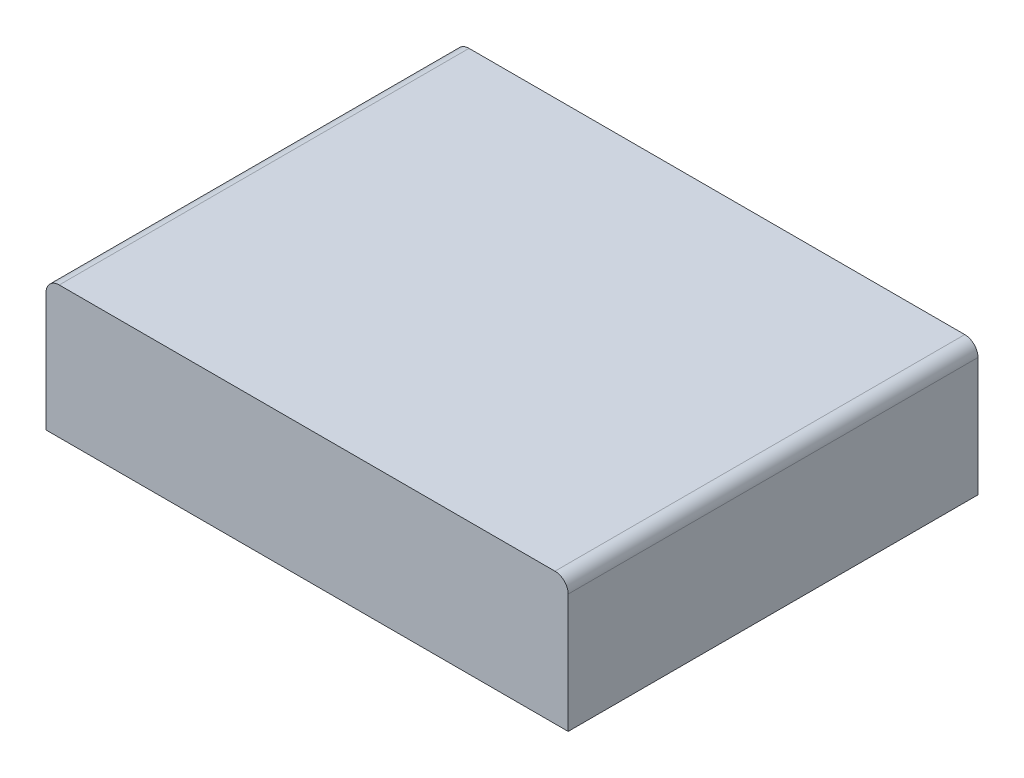
ISO-10303-21;
HEADER;
FILE_DESCRIPTION(('STEP AP214'),'2;1');
FILE_NAME('part.step','',(''),(''),'','','');
FILE_SCHEMA(('AUTOMOTIVE_DESIGN { 1 0 10303 214 1 1 1 1 }'));
ENDSEC;
DATA;
#1=APPLICATION_CONTEXT('core data for automotive mechanical design processes');
#2=APPLICATION_PROTOCOL_DEFINITION('international standard','automotive_design',2000,#1);
#3=PRODUCT_CONTEXT('',#1,'mechanical');
#4=PRODUCT('Part','Part','',(#3));
#5=PRODUCT_RELATED_PRODUCT_CATEGORY('part','',(#4));
#6=PRODUCT_DEFINITION_FORMATION('','',#4);
#7=PRODUCT_DEFINITION_CONTEXT('part definition',#1,'design');
#8=PRODUCT_DEFINITION('design','',#6,#7);
#9=PRODUCT_DEFINITION_SHAPE('','',#8);
#10=(LENGTH_UNIT() NAMED_UNIT(*) SI_UNIT(.MILLI.,.METRE.));
#11=(NAMED_UNIT(*) PLANE_ANGLE_UNIT() SI_UNIT($,.RADIAN.));
#12=(NAMED_UNIT(*) SI_UNIT($,.STERADIAN.) SOLID_ANGLE_UNIT());
#13=UNCERTAINTY_MEASURE_WITH_UNIT(LENGTH_MEASURE(1.E-05),#10,'distance_accuracy_value','');
#14=(GEOMETRIC_REPRESENTATION_CONTEXT(3) GLOBAL_UNCERTAINTY_ASSIGNED_CONTEXT((#13)) GLOBAL_UNIT_ASSIGNED_CONTEXT((#10,
#11,#12)) REPRESENTATION_CONTEXT('',''));
#15=CARTESIAN_POINT('',(0.,0.,0.));
#16=DIRECTION('',(0.,0.,1.));
#17=DIRECTION('',(1.,0.,0.));
#18=AXIS2_PLACEMENT_3D('',#15,#16,#17);
#19=CARTESIAN_POINT('',(-0.348761325789842,39.1976983767566,241.578801425629));
#20=DIRECTION('',(0.,0.,1.));
#21=DIRECTION('',(1.,0.,0.));
#22=AXIS2_PLACEMENT_3D('',#19,#20,#21);
#23=CYLINDRICAL_SURFACE('',#22,0.0508);
#24=CARTESIAN_POINT('',(-0.348761325789842,39.1976983767566,240.791401425628));
#25=DIRECTION('',(0.,0.,1.));
#26=DIRECTION('',(1.,0.,0.));
#27=AXIS2_PLACEMENT_3D('',#24,#25,#26);
#28=CIRCLE('',#27,0.0508);
#29=CARTESIAN_POINT('',(-0.348761325789842,39.2484983767566,240.791401425628));
#30=VERTEX_POINT('',#29);
#31=CARTESIAN_POINT('',(-0.399561325789846,39.1976983767566,240.791401425628));
#32=VERTEX_POINT('',#31);
#33=EDGE_CURVE('E126',#30,#32,#28,.T.);
#34=ORIENTED_EDGE('',*,*,#33,.T.);
#35=DIRECTION('',(0.,0.,-1.));
#36=VECTOR('',#35,1.);
#37=CARTESIAN_POINT('',(-0.399561325789846,39.1976983767566,242.366201425629));
#38=LINE('',#37,#36);
#39=CARTESIAN_POINT('',(-0.399561325789846,39.1976983767566,242.366201425629));
#40=VERTEX_POINT('',#39);
#41=EDGE_CURVE('E108',#32,#40,#38,.F.);
#42=ORIENTED_EDGE('',*,*,#41,.T.);
#43=CARTESIAN_POINT('',(-0.348761325789842,39.1976983767566,242.366201425629));
#44=DIRECTION('',(0.,0.,1.));
#45=DIRECTION('',(1.,0.,0.));
#46=AXIS2_PLACEMENT_3D('',#43,#44,#45);
#47=CIRCLE('',#46,0.0508);
#48=CARTESIAN_POINT('',(-0.348761325789842,39.2484983767566,242.366201425629));
#49=VERTEX_POINT('',#48);
#50=EDGE_CURVE('E20',#40,#49,#47,.F.);
#51=ORIENTED_EDGE('',*,*,#50,.T.);
#52=DIRECTION('',(0.,0.,-1.));
#53=VECTOR('',#52,1.);
#54=CARTESIAN_POINT('',(-0.348761325789842,39.2484983767566,241.578801425629));
#55=LINE('',#54,#53);
#56=EDGE_CURVE('E104',#49,#30,#55,.T.);
#57=ORIENTED_EDGE('',*,*,#56,.T.);
#58=EDGE_LOOP('',(#34,#42,#51,#57));
#59=FACE_BOUND('',#58,.T.);
#60=ADVANCED_FACE('F17',(#59),#23,.T.);
#61=CARTESIAN_POINT('',(1.55623867421015,39.1976983767566,241.578801425629));
#62=DIRECTION('',(0.,0.,-1.));
#63=DIRECTION('',(-1.,0.,0.));
#64=AXIS2_PLACEMENT_3D('',#61,#62,#63);
#65=CYLINDRICAL_SURFACE('',#64,0.0508);
#66=CARTESIAN_POINT('',(1.55623867421015,39.1976983767566,242.366201425629));
#67=DIRECTION('',(0.,0.,-1.));
#68=DIRECTION('',(-1.,0.,0.));
#69=AXIS2_PLACEMENT_3D('',#66,#67,#68);
#70=CIRCLE('',#69,0.0508);
#71=CARTESIAN_POINT('',(1.55623867421015,39.2484983767566,242.366201425629));
#72=VERTEX_POINT('',#71);
#73=CARTESIAN_POINT('',(1.60703867421016,39.1976983767566,242.366201425629));
#74=VERTEX_POINT('',#73);
#75=EDGE_CURVE('E113',#72,#74,#70,.T.);
#76=ORIENTED_EDGE('',*,*,#75,.T.);
#77=DIRECTION('',(0.,0.,1.));
#78=VECTOR('',#77,1.);
#79=CARTESIAN_POINT('',(1.60703867421016,39.1976983767566,242.366201425629));
#80=LINE('',#79,#78);
#81=CARTESIAN_POINT('',(1.60703867421016,39.1976983767566,240.791401425628));
#82=VERTEX_POINT('',#81);
#83=EDGE_CURVE('E100',#74,#82,#80,.F.);
#84=ORIENTED_EDGE('',*,*,#83,.T.);
#85=CARTESIAN_POINT('',(1.55623867421015,39.1976983767566,240.791401425628));
#86=DIRECTION('',(0.,0.,-1.));
#87=DIRECTION('',(-1.,0.,0.));
#88=AXIS2_PLACEMENT_3D('',#85,#86,#87);
#89=CIRCLE('',#88,0.0508);
#90=CARTESIAN_POINT('',(1.55623867421015,39.2484983767566,240.791401425628));
#91=VERTEX_POINT('',#90);
#92=EDGE_CURVE('E122',#82,#91,#89,.F.);
#93=ORIENTED_EDGE('',*,*,#92,.T.);
#94=DIRECTION('',(0.,0.,-1.));
#95=VECTOR('',#94,1.);
#96=CARTESIAN_POINT('',(1.55623867421015,39.2484983767566,241.578801425629));
#97=LINE('',#96,#95);
#98=EDGE_CURVE('E109',#91,#72,#97,.F.);
#99=ORIENTED_EDGE('',*,*,#98,.T.);
#100=EDGE_LOOP('',(#76,#84,#93,#99));
#101=FACE_BOUND('',#100,.T.);
#102=ADVANCED_FACE('F161',(#101),#65,.T.);
#103=CARTESIAN_POINT('',(0.603738674210153,39.2484983767566,241.578801425629));
#104=DIRECTION('',(0.,-1.,0.));
#105=DIRECTION('',(0.,0.,-1.));
#106=AXIS2_PLACEMENT_3D('',#103,#104,#105);
#107=PLANE('',#106);
#108=DIRECTION('',(-1.,0.,0.));
#109=VECTOR('',#108,1.);
#110=CARTESIAN_POINT('',(-0.399561325789846,39.2484983767566,242.366201425629));
#111=LINE('',#110,#109);
#112=EDGE_CURVE('E137',#49,#72,#111,.F.);
#113=ORIENTED_EDGE('',*,*,#112,.T.);
#114=ORIENTED_EDGE('',*,*,#98,.F.);
#115=DIRECTION('',(1.,0.,0.));
#116=VECTOR('',#115,1.);
#117=CARTESIAN_POINT('',(-0.399561325789846,39.2484983767566,240.791401425628));
#118=LINE('',#117,#116);
#119=EDGE_CURVE('E117',#91,#30,#118,.F.);
#120=ORIENTED_EDGE('',*,*,#119,.T.);
#121=ORIENTED_EDGE('',*,*,#56,.F.);
#122=EDGE_LOOP('',(#113,#114,#120,#121));
#123=FACE_BOUND('',#122,.T.);
#124=ADVANCED_FACE('F135',(#123),#107,.F.);
#125=CARTESIAN_POINT('',(-0.399561325789846,39.2484983767566,242.366201425629));
#126=DIRECTION('',(1.,0.,0.));
#127=DIRECTION('',(0.,0.,-1.));
#128=AXIS2_PLACEMENT_3D('',#125,#126,#127);
#129=PLANE('',#128);
#130=DIRECTION('',(0.,1.,0.));
#131=VECTOR('',#130,1.);
#132=CARTESIAN_POINT('',(-0.399561325789846,39.2484983767566,240.791401425628));
#133=LINE('',#132,#131);
#134=CARTESIAN_POINT('',(-0.399561325789846,38.7404983767566,240.791401425628));
#135=VERTEX_POINT('',#134);
#136=EDGE_CURVE('E79',#32,#135,#133,.F.);
#137=ORIENTED_EDGE('',*,*,#136,.T.);
#138=DIRECTION('',(0.,0.,-1.));
#139=VECTOR('',#138,1.);
#140=CARTESIAN_POINT('',(-0.399561325789846,38.7404983767566,241.578801425629));
#141=LINE('',#140,#139);
#142=CARTESIAN_POINT('',(-0.399561325789846,38.7404983767566,242.366201425629));
#143=VERTEX_POINT('',#142);
#144=EDGE_CURVE('E74',#143,#135,#141,.T.);
#145=ORIENTED_EDGE('',*,*,#144,.F.);
#146=DIRECTION('',(0.,1.,0.));
#147=VECTOR('',#146,1.);
#148=CARTESIAN_POINT('',(-0.399561325789846,39.2484983767566,242.366201425629));
#149=LINE('',#148,#147);
#150=EDGE_CURVE('E77',#143,#40,#149,.T.);
#151=ORIENTED_EDGE('',*,*,#150,.T.);
#152=ORIENTED_EDGE('',*,*,#41,.F.);
#153=EDGE_LOOP('',(#137,#145,#151,#152));
#154=FACE_BOUND('',#153,.T.);
#155=ADVANCED_FACE('F75',(#154),#129,.F.);
#156=CARTESIAN_POINT('',(-0.399561325789846,39.2484983767566,240.791401425628));
#157=DIRECTION('',(0.,0.,1.));
#158=DIRECTION('',(1.,0.,0.));
#159=AXIS2_PLACEMENT_3D('',#156,#157,#158);
#160=PLANE('',#159);
#161=ORIENTED_EDGE('',*,*,#119,.F.);
#162=ORIENTED_EDGE('',*,*,#92,.F.);
#163=DIRECTION('',(0.,1.,0.));
#164=VECTOR('',#163,1.);
#165=CARTESIAN_POINT('',(1.60703867421016,39.2484983767566,240.791401425628));
#166=LINE('',#165,#164);
#167=CARTESIAN_POINT('',(1.60703867421016,38.7404983767566,240.791401425628));
#168=VERTEX_POINT('',#167);
#169=EDGE_CURVE('E114',#82,#168,#166,.F.);
#170=ORIENTED_EDGE('',*,*,#169,.T.);
#171=DIRECTION('',(1.,0.,0.));
#172=VECTOR('',#171,1.);
#173=CARTESIAN_POINT('',(0.603738674210153,38.7404983767566,240.791401425628));
#174=LINE('',#173,#172);
#175=EDGE_CURVE('E84',#135,#168,#174,.T.);
#176=ORIENTED_EDGE('',*,*,#175,.F.);
#177=ORIENTED_EDGE('',*,*,#136,.F.);
#178=ORIENTED_EDGE('',*,*,#33,.F.);
#179=EDGE_LOOP('',(#161,#162,#170,#176,#177,#178));
#180=FACE_BOUND('',#179,.T.);
#181=ADVANCED_FACE('F164',(#180),#160,.F.);
#182=CARTESIAN_POINT('',(1.60703867421016,39.2484983767566,242.366201425629));
#183=DIRECTION('',(-1.,0.,0.));
#184=DIRECTION('',(0.,0.,1.));
#185=AXIS2_PLACEMENT_3D('',#182,#183,#184);
#186=PLANE('',#185);
#187=DIRECTION('',(0.,1.,0.));
#188=VECTOR('',#187,1.);
#189=CARTESIAN_POINT('',(1.60703867421016,39.2484983767566,242.366201425629));
#190=LINE('',#189,#188);
#191=CARTESIAN_POINT('',(1.60703867421016,38.7404983767566,242.366201425629));
#192=VERTEX_POINT('',#191);
#193=EDGE_CURVE('E36',#74,#192,#190,.F.);
#194=ORIENTED_EDGE('',*,*,#193,.T.);
#195=DIRECTION('',(0.,0.,-1.));
#196=VECTOR('',#195,1.);
#197=CARTESIAN_POINT('',(1.60703867421016,38.7404983767566,241.578801425629));
#198=LINE('',#197,#196);
#199=EDGE_CURVE('E27',#168,#192,#198,.F.);
#200=ORIENTED_EDGE('',*,*,#199,.F.);
#201=ORIENTED_EDGE('',*,*,#169,.F.);
#202=ORIENTED_EDGE('',*,*,#83,.F.);
#203=EDGE_LOOP('',(#194,#200,#201,#202));
#204=FACE_BOUND('',#203,.T.);
#205=ADVANCED_FACE('F162',(#204),#186,.F.);
#206=CARTESIAN_POINT('',(-0.399561325789846,39.2484983767566,242.366201425629));
#207=DIRECTION('',(0.,0.,-1.));
#208=DIRECTION('',(-1.,0.,0.));
#209=AXIS2_PLACEMENT_3D('',#206,#207,#208);
#210=PLANE('',#209);
#211=ORIENTED_EDGE('',*,*,#150,.F.);
#212=DIRECTION('',(1.,0.,0.));
#213=VECTOR('',#212,1.);
#214=CARTESIAN_POINT('',(0.603738674210153,38.7404983767566,242.366201425629));
#215=LINE('',#214,#213);
#216=EDGE_CURVE('E11',#192,#143,#215,.F.);
#217=ORIENTED_EDGE('',*,*,#216,.F.);
#218=ORIENTED_EDGE('',*,*,#193,.F.);
#219=ORIENTED_EDGE('',*,*,#75,.F.);
#220=ORIENTED_EDGE('',*,*,#112,.F.);
#221=ORIENTED_EDGE('',*,*,#50,.F.);
#222=EDGE_LOOP('',(#211,#217,#218,#219,#220,#221));
#223=FACE_BOUND('',#222,.T.);
#224=ADVANCED_FACE('F86',(#223),#210,.F.);
#225=CARTESIAN_POINT('',(0.603738674210153,38.7404983767566,241.578801425629));
#226=DIRECTION('',(0.,-1.,0.));
#227=DIRECTION('',(0.,0.,-1.));
#228=AXIS2_PLACEMENT_3D('',#225,#226,#227);
#229=PLANE('',#228);
#230=ORIENTED_EDGE('',*,*,#199,.T.);
#231=ORIENTED_EDGE('',*,*,#216,.T.);
#232=ORIENTED_EDGE('',*,*,#144,.T.);
#233=ORIENTED_EDGE('',*,*,#175,.T.);
#234=EDGE_LOOP('',(#230,#231,#232,#233));
#235=FACE_BOUND('',#234,.T.);
#236=ADVANCED_FACE('F90',(#235),#229,.T.);
#237=CLOSED_SHELL('',(#60,#102,#124,#155,#181,#205,#224,#236));
#238=MANIFOLD_SOLID_BREP('B1',#237);
#239=ADVANCED_BREP_SHAPE_REPRESENTATION('',(#18,#238),#14);
#240=SHAPE_DEFINITION_REPRESENTATION(#9,#239);
ENDSEC;
END-ISO-10303-21;
